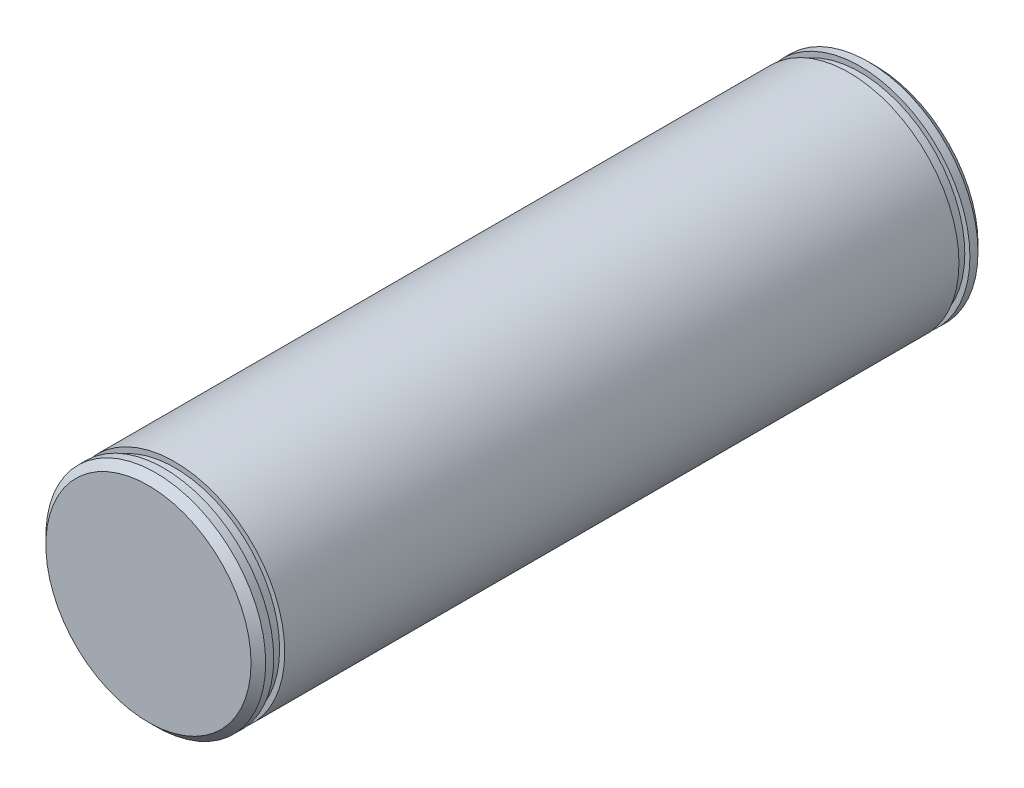
ISO-10303-21;
HEADER;
FILE_DESCRIPTION(('STEP AP214'),'2;1');
FILE_NAME('part.step','',(''),(''),'','','');
FILE_SCHEMA(('AUTOMOTIVE_DESIGN { 1 0 10303 214 1 1 1 1 }'));
ENDSEC;
DATA;
#1=APPLICATION_CONTEXT('core data for automotive mechanical design processes');
#2=APPLICATION_PROTOCOL_DEFINITION('international standard','automotive_design',2000,#1);
#3=PRODUCT_CONTEXT('',#1,'mechanical');
#4=PRODUCT('Part','Part','',(#3));
#5=PRODUCT_RELATED_PRODUCT_CATEGORY('part','',(#4));
#6=PRODUCT_DEFINITION_FORMATION('','',#4);
#7=PRODUCT_DEFINITION_CONTEXT('part definition',#1,'design');
#8=PRODUCT_DEFINITION('design','',#6,#7);
#9=PRODUCT_DEFINITION_SHAPE('','',#8);
#10=(LENGTH_UNIT() NAMED_UNIT(*) SI_UNIT(.MILLI.,.METRE.));
#11=(NAMED_UNIT(*) PLANE_ANGLE_UNIT() SI_UNIT($,.RADIAN.));
#12=(NAMED_UNIT(*) SI_UNIT($,.STERADIAN.) SOLID_ANGLE_UNIT());
#13=UNCERTAINTY_MEASURE_WITH_UNIT(LENGTH_MEASURE(1.E-05),#10,'distance_accuracy_value','');
#14=(GEOMETRIC_REPRESENTATION_CONTEXT(3) GLOBAL_UNCERTAINTY_ASSIGNED_CONTEXT((#13)) GLOBAL_UNIT_ASSIGNED_CONTEXT((#10,
#11,#12)) REPRESENTATION_CONTEXT('',''));
#15=CARTESIAN_POINT('',(0.,0.,0.));
#16=DIRECTION('',(0.,0.,1.));
#17=DIRECTION('',(1.,0.,0.));
#18=AXIS2_PLACEMENT_3D('',#15,#16,#17);
#19=CARTESIAN_POINT('',(0.,0.,46.));
#20=DIRECTION('',(0.,0.,1.));
#21=DIRECTION('',(1.,0.,0.));
#22=AXIS2_PLACEMENT_3D('',#19,#20,#21);
#23=PLANE('',#22);
#24=CARTESIAN_POINT('',(0.,0.,46.));
#25=DIRECTION('',(0.,0.,1.));
#26=DIRECTION('',(1.,0.,0.));
#27=AXIS2_PLACEMENT_3D('',#24,#25,#26);
#28=CIRCLE('',#27,15.);
#29=CARTESIAN_POINT('',(15.,0.,46.));
#30=VERTEX_POINT('',#29);
#31=EDGE_CURVE('E57',#30,#30,#28,.T.);
#32=ORIENTED_EDGE('',*,*,#31,.T.);
#33=EDGE_LOOP('',(#32));
#34=FACE_BOUND('',#33,.T.);
#35=CARTESIAN_POINT('',(0.,0.,46.));
#36=DIRECTION('',(0.,0.,1.));
#37=DIRECTION('',(1.,0.,0.));
#38=AXIS2_PLACEMENT_3D('',#35,#36,#37);
#39=CIRCLE('',#38,14.3);
#40=CARTESIAN_POINT('',(14.3,0.,46.));
#41=VERTEX_POINT('',#40);
#42=EDGE_CURVE('E64',#41,#41,#39,.T.);
#43=ORIENTED_EDGE('',*,*,#42,.F.);
#44=EDGE_LOOP('',(#43));
#45=FACE_BOUND('',#44,.T.);
#46=ADVANCED_FACE('F46',(#34,#45),#23,.T.);
#47=CARTESIAN_POINT('',(0.,0.,46.));
#48=DIRECTION('',(0.,0.,-1.));
#49=DIRECTION('',(-1.,0.,0.));
#50=AXIS2_PLACEMENT_3D('',#47,#48,#49);
#51=CYLINDRICAL_SURFACE('',#50,15.);
#52=ORIENTED_EDGE('',*,*,#31,.F.);
#53=EDGE_LOOP('',(#52));
#54=FACE_BOUND('',#53,.T.);
#55=CARTESIAN_POINT('',(0.,0.,-46.));
#56=DIRECTION('',(0.,0.,1.));
#57=DIRECTION('',(1.,0.,0.));
#58=AXIS2_PLACEMENT_3D('',#55,#56,#57);
#59=CIRCLE('',#58,15.);
#60=CARTESIAN_POINT('',(15.,0.,-46.));
#61=VERTEX_POINT('',#60);
#62=EDGE_CURVE('E78',#61,#61,#59,.T.);
#63=ORIENTED_EDGE('',*,*,#62,.T.);
#64=EDGE_LOOP('',(#63));
#65=FACE_BOUND('',#64,.T.);
#66=ADVANCED_FACE('F111',(#54,#65),#51,.T.);
#67=CARTESIAN_POINT('',(0.,0.,47.5));
#68=DIRECTION('',(0.,0.,-1.));
#69=DIRECTION('',(-1.,0.,0.));
#70=AXIS2_PLACEMENT_3D('',#67,#68,#69);
#71=CYLINDRICAL_SURFACE('',#70,14.3);
#72=CARTESIAN_POINT('',(0.,0.,47.5));
#73=DIRECTION('',(0.,0.,1.));
#74=DIRECTION('',(1.,0.,0.));
#75=AXIS2_PLACEMENT_3D('',#72,#73,#74);
#76=CIRCLE('',#75,14.3);
#77=CARTESIAN_POINT('',(14.3,0.,47.5));
#78=VERTEX_POINT('',#77);
#79=EDGE_CURVE('E61',#78,#78,#76,.T.);
#80=ORIENTED_EDGE('',*,*,#79,.F.);
#81=EDGE_LOOP('',(#80));
#82=FACE_BOUND('',#81,.T.);
#83=ORIENTED_EDGE('',*,*,#42,.T.);
#84=EDGE_LOOP('',(#83));
#85=FACE_BOUND('',#84,.T.);
#86=ADVANCED_FACE('F117',(#82,#85),#71,.T.);
#87=CARTESIAN_POINT('',(0.,0.,47.5));
#88=DIRECTION('',(0.,0.,1.));
#89=DIRECTION('',(1.,0.,0.));
#90=AXIS2_PLACEMENT_3D('',#87,#88,#89);
#91=PLANE('',#90);
#92=CARTESIAN_POINT('',(0.,0.,47.5));
#93=DIRECTION('',(0.,0.,1.));
#94=DIRECTION('',(1.,0.,0.));
#95=AXIS2_PLACEMENT_3D('',#92,#93,#94);
#96=CIRCLE('',#95,15.);
#97=CARTESIAN_POINT('',(15.,0.,47.5));
#98=VERTEX_POINT('',#97);
#99=EDGE_CURVE('E67',#98,#98,#96,.T.);
#100=ORIENTED_EDGE('',*,*,#99,.F.);
#101=EDGE_LOOP('',(#100));
#102=FACE_BOUND('',#101,.T.);
#103=ORIENTED_EDGE('',*,*,#79,.T.);
#104=EDGE_LOOP('',(#103));
#105=FACE_BOUND('',#104,.T.);
#106=ADVANCED_FACE('F123',(#102,#105),#91,.F.);
#107=CARTESIAN_POINT('',(0.,0.,49.6));
#108=DIRECTION('',(0.,0.,-1.));
#109=DIRECTION('',(-1.,0.,0.));
#110=AXIS2_PLACEMENT_3D('',#107,#108,#109);
#111=CYLINDRICAL_SURFACE('',#110,15.);
#112=CARTESIAN_POINT('',(0.,0.,48.6));
#113=DIRECTION('',(0.,0.,1.));
#114=DIRECTION('',(1.,0.,0.));
#115=AXIS2_PLACEMENT_3D('',#112,#113,#114);
#116=CIRCLE('',#115,15.);
#117=CARTESIAN_POINT('',(15.,0.,48.6));
#118=VERTEX_POINT('',#117);
#119=EDGE_CURVE('E12',#118,#118,#116,.F.);
#120=ORIENTED_EDGE('',*,*,#119,.T.);
#121=EDGE_LOOP('',(#120));
#122=FACE_BOUND('',#121,.T.);
#123=ORIENTED_EDGE('',*,*,#99,.T.);
#124=EDGE_LOOP('',(#123));
#125=FACE_BOUND('',#124,.T.);
#126=ADVANCED_FACE('F125',(#122,#125),#111,.T.);
#127=CARTESIAN_POINT('',(0.,0.,49.6));
#128=DIRECTION('',(0.,0.,1.));
#129=DIRECTION('',(1.,0.,0.));
#130=AXIS2_PLACEMENT_3D('',#127,#128,#129);
#131=PLANE('',#130);
#132=CARTESIAN_POINT('',(0.,0.,49.6));
#133=DIRECTION('',(0.,0.,1.));
#134=DIRECTION('',(1.,0.,0.));
#135=AXIS2_PLACEMENT_3D('',#132,#133,#134);
#136=CIRCLE('',#135,14.);
#137=CARTESIAN_POINT('',(14.,0.,49.6));
#138=VERTEX_POINT('',#137);
#139=EDGE_CURVE('E53',#138,#138,#136,.T.);
#140=ORIENTED_EDGE('',*,*,#139,.T.);
#141=EDGE_LOOP('',(#140));
#142=FACE_BOUND('',#141,.T.);
#143=ADVANCED_FACE('F128',(#142),#131,.T.);
#144=CARTESIAN_POINT('',(0.,0.,49.6));
#145=DIRECTION('',(0.,0.,-1.));
#146=DIRECTION('',(-1.,0.,0.));
#147=AXIS2_PLACEMENT_3D('',#144,#145,#146);
#148=CONICAL_SURFACE('',#147,14.,0.785398163397448);
#149=ORIENTED_EDGE('',*,*,#119,.F.);
#150=EDGE_LOOP('',(#149));
#151=FACE_BOUND('',#150,.T.);
#152=ORIENTED_EDGE('',*,*,#139,.F.);
#153=EDGE_LOOP('',(#152));
#154=FACE_BOUND('',#153,.T.);
#155=ADVANCED_FACE('F48',(#151,#154),#148,.T.);
#156=CARTESIAN_POINT('',(0.,0.,-46.));
#157=DIRECTION('',(0.,0.,-1.));
#158=DIRECTION('',(1.,0.,0.));
#159=AXIS2_PLACEMENT_3D('',#156,#157,#158);
#160=PLANE('',#159);
#161=ORIENTED_EDGE('',*,*,#62,.F.);
#162=EDGE_LOOP('',(#161));
#163=FACE_BOUND('',#162,.T.);
#164=CARTESIAN_POINT('',(0.,0.,-46.));
#165=DIRECTION('',(0.,0.,1.));
#166=DIRECTION('',(1.,0.,0.));
#167=AXIS2_PLACEMENT_3D('',#164,#165,#166);
#168=CIRCLE('',#167,14.3);
#169=CARTESIAN_POINT('',(14.3,0.,-46.));
#170=VERTEX_POINT('',#169);
#171=EDGE_CURVE('E82',#170,#170,#168,.T.);
#172=ORIENTED_EDGE('',*,*,#171,.T.);
#173=EDGE_LOOP('',(#172));
#174=FACE_BOUND('',#173,.T.);
#175=ADVANCED_FACE('F137',(#163,#174),#160,.T.);
#176=CARTESIAN_POINT('',(0.,0.,-47.5));
#177=DIRECTION('',(0.,0.,1.));
#178=DIRECTION('',(-1.,0.,0.));
#179=AXIS2_PLACEMENT_3D('',#176,#177,#178);
#180=CYLINDRICAL_SURFACE('',#179,14.3);
#181=CARTESIAN_POINT('',(0.,0.,-47.5));
#182=DIRECTION('',(0.,0.,1.));
#183=DIRECTION('',(1.,0.,0.));
#184=AXIS2_PLACEMENT_3D('',#181,#182,#183);
#185=CIRCLE('',#184,14.3);
#186=CARTESIAN_POINT('',(14.3,0.,-47.5));
#187=VERTEX_POINT('',#186);
#188=EDGE_CURVE('E81',#187,#187,#185,.T.);
#189=ORIENTED_EDGE('',*,*,#188,.T.);
#190=EDGE_LOOP('',(#189));
#191=FACE_BOUND('',#190,.T.);
#192=ORIENTED_EDGE('',*,*,#171,.F.);
#193=EDGE_LOOP('',(#192));
#194=FACE_BOUND('',#193,.T.);
#195=ADVANCED_FACE('F106',(#191,#194),#180,.T.);
#196=CARTESIAN_POINT('',(0.,0.,-47.5));
#197=DIRECTION('',(0.,0.,-1.));
#198=DIRECTION('',(1.,0.,0.));
#199=AXIS2_PLACEMENT_3D('',#196,#197,#198);
#200=PLANE('',#199);
#201=CARTESIAN_POINT('',(0.,0.,-47.5));
#202=DIRECTION('',(0.,0.,1.));
#203=DIRECTION('',(1.,0.,0.));
#204=AXIS2_PLACEMENT_3D('',#201,#202,#203);
#205=CIRCLE('',#204,15.);
#206=CARTESIAN_POINT('',(15.,0.,-47.5));
#207=VERTEX_POINT('',#206);
#208=EDGE_CURVE('E85',#207,#207,#205,.T.);
#209=ORIENTED_EDGE('',*,*,#208,.T.);
#210=EDGE_LOOP('',(#209));
#211=FACE_BOUND('',#210,.T.);
#212=ORIENTED_EDGE('',*,*,#188,.F.);
#213=EDGE_LOOP('',(#212));
#214=FACE_BOUND('',#213,.T.);
#215=ADVANCED_FACE('F91',(#211,#214),#200,.F.);
#216=CARTESIAN_POINT('',(0.,0.,-49.6));
#217=DIRECTION('',(0.,0.,1.));
#218=DIRECTION('',(-1.,0.,0.));
#219=AXIS2_PLACEMENT_3D('',#216,#217,#218);
#220=CYLINDRICAL_SURFACE('',#219,15.);
#221=CARTESIAN_POINT('',(0.,0.,-48.6));
#222=DIRECTION('',(0.,0.,1.));
#223=DIRECTION('',(1.,0.,0.));
#224=AXIS2_PLACEMENT_3D('',#221,#222,#223);
#225=CIRCLE('',#224,15.);
#226=CARTESIAN_POINT('',(15.,0.,-48.6));
#227=VERTEX_POINT('',#226);
#228=EDGE_CURVE('E72',#227,#227,#225,.F.);
#229=ORIENTED_EDGE('',*,*,#228,.F.);
#230=EDGE_LOOP('',(#229));
#231=FACE_BOUND('',#230,.T.);
#232=ORIENTED_EDGE('',*,*,#208,.F.);
#233=EDGE_LOOP('',(#232));
#234=FACE_BOUND('',#233,.T.);
#235=ADVANCED_FACE('F94',(#231,#234),#220,.T.);
#236=CARTESIAN_POINT('',(0.,0.,-49.6));
#237=DIRECTION('',(0.,0.,-1.));
#238=DIRECTION('',(1.,0.,0.));
#239=AXIS2_PLACEMENT_3D('',#236,#237,#238);
#240=PLANE('',#239);
#241=CARTESIAN_POINT('',(0.,0.,-49.6));
#242=DIRECTION('',(0.,0.,1.));
#243=DIRECTION('',(1.,0.,0.));
#244=AXIS2_PLACEMENT_3D('',#241,#242,#243);
#245=CIRCLE('',#244,14.);
#246=CARTESIAN_POINT('',(14.,0.,-49.6));
#247=VERTEX_POINT('',#246);
#248=EDGE_CURVE('E75',#247,#247,#245,.T.);
#249=ORIENTED_EDGE('',*,*,#248,.F.);
#250=EDGE_LOOP('',(#249));
#251=FACE_BOUND('',#250,.T.);
#252=ADVANCED_FACE('F96',(#251),#240,.T.);
#253=CARTESIAN_POINT('',(0.,0.,-49.6));
#254=DIRECTION('',(0.,0.,1.));
#255=DIRECTION('',(-1.,0.,0.));
#256=AXIS2_PLACEMENT_3D('',#253,#254,#255);
#257=CONICAL_SURFACE('',#256,14.,0.785398163397448);
#258=ORIENTED_EDGE('',*,*,#228,.T.);
#259=EDGE_LOOP('',(#258));
#260=FACE_BOUND('',#259,.T.);
#261=ORIENTED_EDGE('',*,*,#248,.T.);
#262=EDGE_LOOP('',(#261));
#263=FACE_BOUND('',#262,.T.);
#264=ADVANCED_FACE('F103',(#260,#263),#257,.T.);
#265=CLOSED_SHELL('',(#46,#66,#86,#106,#126,#143,#155,#175,#195,#215,#235,#252,#264));
#266=MANIFOLD_SOLID_BREP('B2',#265);
#267=ADVANCED_BREP_SHAPE_REPRESENTATION('',(#18,#266),#14);
#268=SHAPE_DEFINITION_REPRESENTATION(#9,#267);
ENDSEC;
END-ISO-10303-21;
